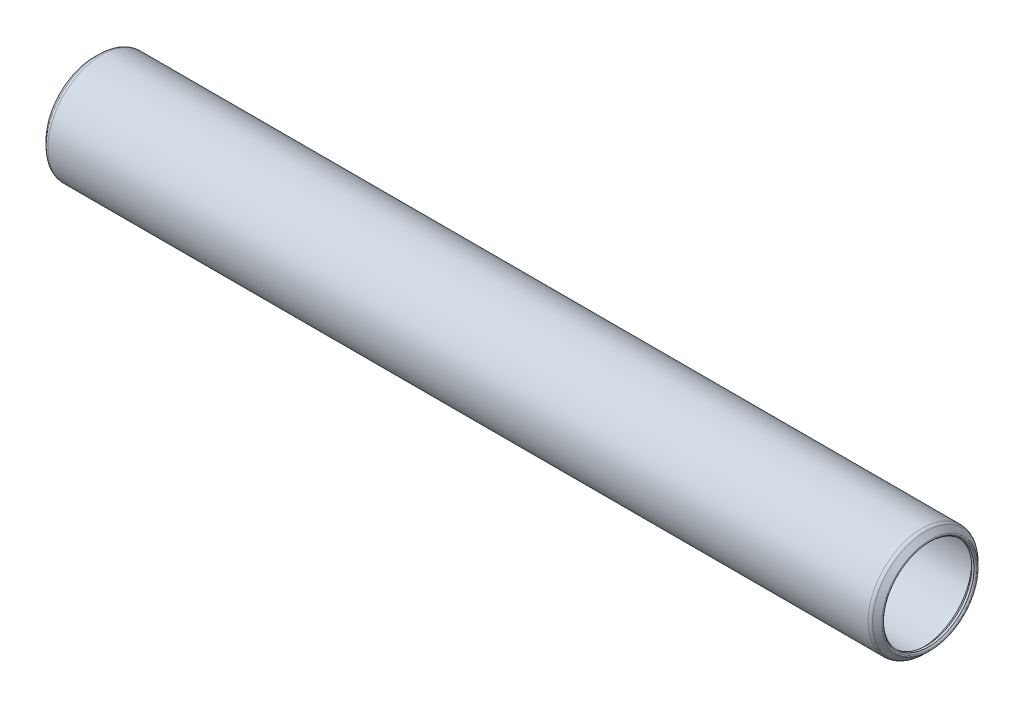
ISO-10303-21;
HEADER;
FILE_DESCRIPTION(('STEP AP214'),'2;1');
FILE_NAME('part.step','',(''),(''),'','','');
FILE_SCHEMA(('AUTOMOTIVE_DESIGN { 1 0 10303 214 1 1 1 1 }'));
ENDSEC;
DATA;
#1=APPLICATION_CONTEXT('core data for automotive mechanical design processes');
#2=APPLICATION_PROTOCOL_DEFINITION('international standard','automotive_design',2000,#1);
#3=PRODUCT_CONTEXT('',#1,'mechanical');
#4=PRODUCT('Part','Part','',(#3));
#5=PRODUCT_RELATED_PRODUCT_CATEGORY('part','',(#4));
#6=PRODUCT_DEFINITION_FORMATION('','',#4);
#7=PRODUCT_DEFINITION_CONTEXT('part definition',#1,'design');
#8=PRODUCT_DEFINITION('design','',#6,#7);
#9=PRODUCT_DEFINITION_SHAPE('','',#8);
#10=(LENGTH_UNIT() NAMED_UNIT(*) SI_UNIT(.MILLI.,.METRE.));
#11=(NAMED_UNIT(*) PLANE_ANGLE_UNIT() SI_UNIT($,.RADIAN.));
#12=(NAMED_UNIT(*) SI_UNIT($,.STERADIAN.) SOLID_ANGLE_UNIT());
#13=UNCERTAINTY_MEASURE_WITH_UNIT(LENGTH_MEASURE(1.E-05),#10,'distance_accuracy_value','');
#14=(GEOMETRIC_REPRESENTATION_CONTEXT(3) GLOBAL_UNCERTAINTY_ASSIGNED_CONTEXT((#13)) GLOBAL_UNIT_ASSIGNED_CONTEXT((#10,
#11,#12)) REPRESENTATION_CONTEXT('',''));
#15=CARTESIAN_POINT('',(0.,0.,0.));
#16=DIRECTION('',(0.,0.,1.));
#17=DIRECTION('',(1.,0.,0.));
#18=AXIS2_PLACEMENT_3D('',#15,#16,#17);
#19=CARTESIAN_POINT('',(-0.306605122421362,0.,0.));
#20=DIRECTION('',(-1.,0.,0.));
#21=DIRECTION('',(0.,0.,1.));
#22=AXIS2_PLACEMENT_3D('',#19,#20,#21);
#23=TOROIDAL_SURFACE('',#22,5.3947602448428,0.127000000000018);
#24=CARTESIAN_POINT('',(-0.396407683632069,0.,0.));
#25=DIRECTION('',(-1.,0.,0.));
#26=DIRECTION('',(0.,0.,1.));
#27=AXIS2_PLACEMENT_3D('',#24,#25,#26);
#28=CIRCLE('',#27,5.3049576836321);
#29=CARTESIAN_POINT('',(-0.396407683632069,0.,5.3049576836321));
#30=VERTEX_POINT('',#29);
#31=EDGE_CURVE('E10',#30,#30,#28,.T.);
#32=ORIENTED_EDGE('',*,*,#31,.F.);
#33=EDGE_LOOP('',(#32));
#34=FACE_BOUND('',#33,.T.);
#35=CARTESIAN_POINT('',(-0.396407683632069,0.,0.));
#36=DIRECTION('',(-1.,0.,0.));
#37=DIRECTION('',(0.,0.,1.));
#38=AXIS2_PLACEMENT_3D('',#35,#36,#37);
#39=CIRCLE('',#38,5.4845628060535);
#40=CARTESIAN_POINT('',(-0.396407683632069,0.,5.4845628060535));
#41=VERTEX_POINT('',#40);
#42=EDGE_CURVE('E77',#41,#41,#39,.T.);
#43=ORIENTED_EDGE('',*,*,#42,.T.);
#44=EDGE_LOOP('',(#43));
#45=FACE_BOUND('',#44,.T.);
#46=ADVANCED_FACE('F31',(#34,#45),#23,.T.);
#47=CARTESIAN_POINT('',(-0.396407683632069,0.,0.));
#48=DIRECTION('',(-1.,0.,0.));
#49=DIRECTION('',(0.,0.,1.));
#50=AXIS2_PLACEMENT_3D('',#47,#48,#49);
#51=CONICAL_SURFACE('',#50,5.3049576836321,0.78539816339757);
#52=CARTESIAN_POINT('',(-0.254000000000004,0.,0.));
#53=DIRECTION('',(-1.,0.,0.));
#54=DIRECTION('',(0.,0.,1.));
#55=AXIS2_PLACEMENT_3D('',#52,#53,#54);
#56=CIRCLE('',#55,5.16255);
#57=CARTESIAN_POINT('',(-0.254000000000004,0.,5.16255));
#58=VERTEX_POINT('',#57);
#59=EDGE_CURVE('E37',#58,#58,#56,.T.);
#60=ORIENTED_EDGE('',*,*,#59,.F.);
#61=EDGE_LOOP('',(#60));
#62=FACE_BOUND('',#61,.T.);
#63=ORIENTED_EDGE('',*,*,#31,.T.);
#64=EDGE_LOOP('',(#63));
#65=FACE_BOUND('',#64,.T.);
#66=ADVANCED_FACE('F150',(#62,#65),#51,.F.);
#67=CARTESIAN_POINT('',(94.4372,0.,0.));
#68=DIRECTION('',(-1.,0.,0.));
#69=DIRECTION('',(0.,0.,1.));
#70=AXIS2_PLACEMENT_3D('',#67,#68,#69);
#71=CYLINDRICAL_SURFACE('',#70,5.16255);
#72=CARTESIAN_POINT('',(0.,0.,0.));
#73=DIRECTION('',(-1.,0.,0.));
#74=DIRECTION('',(0.,0.,1.));
#75=AXIS2_PLACEMENT_3D('',#72,#73,#74);
#76=CIRCLE('',#75,5.16255);
#77=CARTESIAN_POINT('',(0.,0.,5.16255));
#78=VERTEX_POINT('',#77);
#79=EDGE_CURVE('E41',#78,#78,#76,.T.);
#80=ORIENTED_EDGE('',*,*,#79,.F.);
#81=EDGE_LOOP('',(#80));
#82=FACE_BOUND('',#81,.T.);
#83=ORIENTED_EDGE('',*,*,#59,.T.);
#84=EDGE_LOOP('',(#83));
#85=FACE_BOUND('',#84,.T.);
#86=ADVANCED_FACE('F145',(#82,#85),#71,.F.);
#87=CARTESIAN_POINT('',(0.,0.,0.));
#88=DIRECTION('',(1.,0.,0.));
#89=DIRECTION('',(0.,0.,-1.));
#90=AXIS2_PLACEMENT_3D('',#87,#88,#89);
#91=CONICAL_SURFACE('',#90,5.16255,0.785398163397453);
#92=CARTESIAN_POINT('',(0.507999999999995,0.,0.));
#93=DIRECTION('',(-1.,0.,0.));
#94=DIRECTION('',(0.,0.,1.));
#95=AXIS2_PLACEMENT_3D('',#92,#93,#94);
#96=CIRCLE('',#95,5.67055);
#97=CARTESIAN_POINT('',(0.507999999999995,0.,5.67055));
#98=VERTEX_POINT('',#97);
#99=EDGE_CURVE('E45',#98,#98,#96,.T.);
#100=ORIENTED_EDGE('',*,*,#99,.F.);
#101=EDGE_LOOP('',(#100));
#102=FACE_BOUND('',#101,.T.);
#103=ORIENTED_EDGE('',*,*,#79,.T.);
#104=EDGE_LOOP('',(#103));
#105=FACE_BOUND('',#104,.T.);
#106=ADVANCED_FACE('F139',(#102,#105),#91,.F.);
#107=CARTESIAN_POINT('',(94.4372,0.,0.));
#108=DIRECTION('',(-1.,0.,0.));
#109=DIRECTION('',(0.,0.,1.));
#110=AXIS2_PLACEMENT_3D('',#107,#108,#109);
#111=CYLINDRICAL_SURFACE('',#110,5.67055);
#112=CARTESIAN_POINT('',(93.9292,0.,0.));
#113=DIRECTION('',(-1.,0.,0.));
#114=DIRECTION('',(0.,0.,1.));
#115=AXIS2_PLACEMENT_3D('',#112,#113,#114);
#116=CIRCLE('',#115,5.67055);
#117=CARTESIAN_POINT('',(93.9292,0.,5.67055));
#118=VERTEX_POINT('',#117);
#119=EDGE_CURVE('E50',#118,#118,#116,.T.);
#120=ORIENTED_EDGE('',*,*,#119,.F.);
#121=EDGE_LOOP('',(#120));
#122=FACE_BOUND('',#121,.T.);
#123=ORIENTED_EDGE('',*,*,#99,.T.);
#124=EDGE_LOOP('',(#123));
#125=FACE_BOUND('',#124,.T.);
#126=ADVANCED_FACE('F133',(#122,#125),#111,.F.);
#127=CARTESIAN_POINT('',(93.9292,0.,0.));
#128=DIRECTION('',(-1.,0.,0.));
#129=DIRECTION('',(0.,0.,1.));
#130=AXIS2_PLACEMENT_3D('',#127,#128,#129);
#131=CONICAL_SURFACE('',#130,5.67055,0.785398163397453);
#132=CARTESIAN_POINT('',(94.4372,0.,0.));
#133=DIRECTION('',(-1.,0.,0.));
#134=DIRECTION('',(0.,0.,1.));
#135=AXIS2_PLACEMENT_3D('',#132,#133,#134);
#136=CIRCLE('',#135,5.16255);
#137=CARTESIAN_POINT('',(94.4372,0.,5.16255));
#138=VERTEX_POINT('',#137);
#139=EDGE_CURVE('E53',#138,#138,#136,.T.);
#140=ORIENTED_EDGE('',*,*,#139,.F.);
#141=EDGE_LOOP('',(#140));
#142=FACE_BOUND('',#141,.T.);
#143=ORIENTED_EDGE('',*,*,#119,.T.);
#144=EDGE_LOOP('',(#143));
#145=FACE_BOUND('',#144,.T.);
#146=ADVANCED_FACE('F127',(#142,#145),#131,.F.);
#147=CARTESIAN_POINT('',(94.4372,0.,0.));
#148=DIRECTION('',(-1.,0.,0.));
#149=DIRECTION('',(0.,0.,1.));
#150=AXIS2_PLACEMENT_3D('',#147,#148,#149);
#151=CYLINDRICAL_SURFACE('',#150,5.16255);
#152=CARTESIAN_POINT('',(94.6912,0.,0.));
#153=DIRECTION('',(-1.,0.,0.));
#154=DIRECTION('',(0.,0.,1.));
#155=AXIS2_PLACEMENT_3D('',#152,#153,#154);
#156=CIRCLE('',#155,5.16255);
#157=CARTESIAN_POINT('',(94.6912,0.,5.16255));
#158=VERTEX_POINT('',#157);
#159=EDGE_CURVE('E56',#158,#158,#156,.T.);
#160=ORIENTED_EDGE('',*,*,#159,.F.);
#161=EDGE_LOOP('',(#160));
#162=FACE_BOUND('',#161,.T.);
#163=ORIENTED_EDGE('',*,*,#139,.T.);
#164=EDGE_LOOP('',(#163));
#165=FACE_BOUND('',#164,.T.);
#166=ADVANCED_FACE('F121',(#162,#165),#151,.F.);
#167=CARTESIAN_POINT('',(94.6912,0.,0.));
#168=DIRECTION('',(1.,0.,0.));
#169=DIRECTION('',(0.,0.,-1.));
#170=AXIS2_PLACEMENT_3D('',#167,#168,#169);
#171=CONICAL_SURFACE('',#170,5.16255,0.785398163397814);
#172=CARTESIAN_POINT('',(94.833607683632,0.,0.));
#173=DIRECTION('',(-1.,0.,0.));
#174=DIRECTION('',(0.,0.,1.));
#175=AXIS2_PLACEMENT_3D('',#172,#173,#174);
#176=CIRCLE('',#175,5.3049576836321);
#177=CARTESIAN_POINT('',(94.833607683632,0.,5.3049576836321));
#178=VERTEX_POINT('',#177);
#179=EDGE_CURVE('E59',#178,#178,#176,.T.);
#180=ORIENTED_EDGE('',*,*,#179,.F.);
#181=EDGE_LOOP('',(#180));
#182=FACE_BOUND('',#181,.T.);
#183=ORIENTED_EDGE('',*,*,#159,.T.);
#184=EDGE_LOOP('',(#183));
#185=FACE_BOUND('',#184,.T.);
#186=ADVANCED_FACE('F115',(#182,#185),#171,.F.);
#187=CARTESIAN_POINT('',(94.7438051224203,0.,0.));
#188=DIRECTION('',(-1.,0.,0.));
#189=DIRECTION('',(0.,0.,1.));
#190=AXIS2_PLACEMENT_3D('',#187,#188,#189);
#191=TOROIDAL_SURFACE('',#190,5.3947602448428,0.12700000000075);
#192=CARTESIAN_POINT('',(94.833607683632,0.,0.));
#193=DIRECTION('',(-1.,0.,0.));
#194=DIRECTION('',(0.,0.,1.));
#195=AXIS2_PLACEMENT_3D('',#192,#193,#194);
#196=CIRCLE('',#195,5.4845628060535);
#197=CARTESIAN_POINT('',(94.833607683632,0.,5.4845628060535));
#198=VERTEX_POINT('',#197);
#199=EDGE_CURVE('E62',#198,#198,#196,.T.);
#200=ORIENTED_EDGE('',*,*,#199,.F.);
#201=EDGE_LOOP('',(#200));
#202=FACE_BOUND('',#201,.T.);
#203=ORIENTED_EDGE('',*,*,#179,.T.);
#204=EDGE_LOOP('',(#203));
#205=FACE_BOUND('',#204,.T.);
#206=ADVANCED_FACE('F109',(#202,#205),#191,.T.);
#207=CARTESIAN_POINT('',(94.833607683632,0.,0.));
#208=DIRECTION('',(-1.,0.,0.));
#209=DIRECTION('',(0.,0.,1.));
#210=AXIS2_PLACEMENT_3D('',#207,#208,#209);
#211=CONICAL_SURFACE('',#210,5.4845628060535,0.785398163397731);
#212=CARTESIAN_POINT('',(94.301110244843,0.,0.));
#213=DIRECTION('',(-1.,0.,0.));
#214=DIRECTION('',(0.,0.,1.));
#215=AXIS2_PLACEMENT_3D('',#212,#213,#214);
#216=CIRCLE('',#215,6.0170602448428);
#217=CARTESIAN_POINT('',(94.301110244843,0.,6.0170602448428));
#218=VERTEX_POINT('',#217);
#219=EDGE_CURVE('E65',#218,#218,#216,.T.);
#220=ORIENTED_EDGE('',*,*,#219,.F.);
#221=EDGE_LOOP('',(#220));
#222=FACE_BOUND('',#221,.T.);
#223=ORIENTED_EDGE('',*,*,#199,.T.);
#224=EDGE_LOOP('',(#223));
#225=FACE_BOUND('',#224,.T.);
#226=ADVANCED_FACE('F103',(#222,#225),#211,.T.);
#227=CARTESIAN_POINT('',(93.9418999999987,0.,0.));
#228=DIRECTION('',(-1.,0.,0.));
#229=DIRECTION('',(0.,0.,1.));
#230=AXIS2_PLACEMENT_3D('',#227,#228,#229);
#231=TOROIDAL_SURFACE('',#230,5.6578499999962,0.508000000003804);
#232=CARTESIAN_POINT('',(93.9419,0.,0.));
#233=DIRECTION('',(-1.,0.,0.));
#234=DIRECTION('',(0.,0.,1.));
#235=AXIS2_PLACEMENT_3D('',#232,#233,#234);
#236=CIRCLE('',#235,6.16585);
#237=CARTESIAN_POINT('',(93.9419,0.,6.16585));
#238=VERTEX_POINT('',#237);
#239=EDGE_CURVE('E68',#238,#238,#236,.T.);
#240=ORIENTED_EDGE('',*,*,#239,.F.);
#241=EDGE_LOOP('',(#240));
#242=FACE_BOUND('',#241,.T.);
#243=ORIENTED_EDGE('',*,*,#219,.T.);
#244=EDGE_LOOP('',(#243));
#245=FACE_BOUND('',#244,.T.);
#246=ADVANCED_FACE('F97',(#242,#245),#231,.T.);
#247=CARTESIAN_POINT('',(94.4372,0.,0.));
#248=DIRECTION('',(-1.,0.,0.));
#249=DIRECTION('',(0.,0.,1.));
#250=AXIS2_PLACEMENT_3D('',#247,#248,#249);
#251=CYLINDRICAL_SURFACE('',#250,6.16585);
#252=CARTESIAN_POINT('',(0.495300000000004,0.,0.));
#253=DIRECTION('',(-1.,0.,0.));
#254=DIRECTION('',(0.,0.,1.));
#255=AXIS2_PLACEMENT_3D('',#252,#253,#254);
#256=CIRCLE('',#255,6.16585);
#257=CARTESIAN_POINT('',(0.495300000000004,0.,6.16585));
#258=VERTEX_POINT('',#257);
#259=EDGE_CURVE('E71',#258,#258,#256,.T.);
#260=ORIENTED_EDGE('',*,*,#259,.F.);
#261=EDGE_LOOP('',(#260));
#262=FACE_BOUND('',#261,.T.);
#263=ORIENTED_EDGE('',*,*,#239,.T.);
#264=EDGE_LOOP('',(#263));
#265=FACE_BOUND('',#264,.T.);
#266=ADVANCED_FACE('F91',(#262,#265),#251,.T.);
#267=CARTESIAN_POINT('',(0.495300000000181,0.,0.));
#268=DIRECTION('',(-1.,0.,0.));
#269=DIRECTION('',(0.,0.,1.));
#270=AXIS2_PLACEMENT_3D('',#267,#268,#269);
#271=TOROIDAL_SURFACE('',#270,5.65784999999947,0.50800000000053);
#272=CARTESIAN_POINT('',(0.136089755157234,0.,0.));
#273=DIRECTION('',(-1.,0.,0.));
#274=DIRECTION('',(0.,0.,1.));
#275=AXIS2_PLACEMENT_3D('',#272,#273,#274);
#276=CIRCLE('',#275,6.0170602448428);
#277=CARTESIAN_POINT('',(0.136089755157234,0.,6.0170602448428));
#278=VERTEX_POINT('',#277);
#279=EDGE_CURVE('E74',#278,#278,#276,.T.);
#280=ORIENTED_EDGE('',*,*,#279,.F.);
#281=EDGE_LOOP('',(#280));
#282=FACE_BOUND('',#281,.T.);
#283=ORIENTED_EDGE('',*,*,#259,.T.);
#284=EDGE_LOOP('',(#283));
#285=FACE_BOUND('',#284,.T.);
#286=ADVANCED_FACE('F85',(#282,#285),#271,.T.);
#287=CARTESIAN_POINT('',(0.136089755157234,0.,0.));
#288=DIRECTION('',(1.,0.,0.));
#289=DIRECTION('',(0.,0.,-1.));
#290=AXIS2_PLACEMENT_3D('',#287,#288,#289);
#291=CONICAL_SURFACE('',#290,6.0170602448428,0.785398163397445);
#292=ORIENTED_EDGE('',*,*,#42,.F.);
#293=EDGE_LOOP('',(#292));
#294=FACE_BOUND('',#293,.T.);
#295=ORIENTED_EDGE('',*,*,#279,.T.);
#296=EDGE_LOOP('',(#295));
#297=FACE_BOUND('',#296,.T.);
#298=ADVANCED_FACE('F82',(#294,#297),#291,.T.);
#299=CLOSED_SHELL('',(#46,#66,#86,#106,#126,#146,#166,#186,#206,#226,#246,#266,#286,#298));
#300=MANIFOLD_SOLID_BREP('B2',#299);
#301=ADVANCED_BREP_SHAPE_REPRESENTATION('',(#18,#300),#14);
#302=SHAPE_DEFINITION_REPRESENTATION(#9,#301);
ENDSEC;
END-ISO-10303-21;
